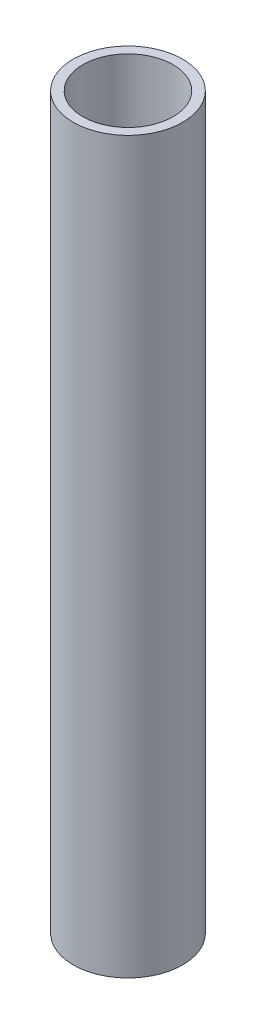
ISO-10303-21;
HEADER;
FILE_DESCRIPTION(('STEP AP214'),'2;1');
FILE_NAME('part.step','',(''),(''),'','','');
FILE_SCHEMA(('AUTOMOTIVE_DESIGN { 1 0 10303 214 1 1 1 1 }'));
ENDSEC;
DATA;
#1=APPLICATION_CONTEXT('core data for automotive mechanical design processes');
#2=APPLICATION_PROTOCOL_DEFINITION('international standard','automotive_design',2000,#1);
#3=PRODUCT_CONTEXT('',#1,'mechanical');
#4=PRODUCT('Part','Part','',(#3));
#5=PRODUCT_RELATED_PRODUCT_CATEGORY('part','',(#4));
#6=PRODUCT_DEFINITION_FORMATION('','',#4);
#7=PRODUCT_DEFINITION_CONTEXT('part definition',#1,'design');
#8=PRODUCT_DEFINITION('design','',#6,#7);
#9=PRODUCT_DEFINITION_SHAPE('','',#8);
#10=(LENGTH_UNIT() NAMED_UNIT(*) SI_UNIT(.MILLI.,.METRE.));
#11=(NAMED_UNIT(*) PLANE_ANGLE_UNIT() SI_UNIT($,.RADIAN.));
#12=(NAMED_UNIT(*) SI_UNIT($,.STERADIAN.) SOLID_ANGLE_UNIT());
#13=UNCERTAINTY_MEASURE_WITH_UNIT(LENGTH_MEASURE(1.E-05),#10,'distance_accuracy_value','');
#14=(GEOMETRIC_REPRESENTATION_CONTEXT(3) GLOBAL_UNCERTAINTY_ASSIGNED_CONTEXT((#13)) GLOBAL_UNIT_ASSIGNED_CONTEXT((#10,
#11,#12)) REPRESENTATION_CONTEXT('',''));
#15=CARTESIAN_POINT('',(0.,0.,0.));
#16=DIRECTION('',(0.,0.,1.));
#17=DIRECTION('',(1.,0.,0.));
#18=AXIS2_PLACEMENT_3D('',#15,#16,#17);
#19=CARTESIAN_POINT('',(0.,38.,0.));
#20=DIRECTION('',(0.,1.,0.));
#21=DIRECTION('',(0.,0.,1.));
#22=AXIS2_PLACEMENT_3D('',#19,#20,#21);
#23=PLANE('',#22);
#24=CARTESIAN_POINT('',(0.,38.,0.));
#25=DIRECTION('',(0.,1.,0.));
#26=DIRECTION('',(0.,0.,1.));
#27=AXIS2_PLACEMENT_3D('',#24,#25,#26);
#28=CIRCLE('',#27,2.85);
#29=CARTESIAN_POINT('',(0.,38.,2.85));
#30=VERTEX_POINT('',#29);
#31=EDGE_CURVE('E10',#30,#30,#28,.T.);
#32=ORIENTED_EDGE('',*,*,#31,.T.);
#33=EDGE_LOOP('',(#32));
#34=FACE_BOUND('',#33,.T.);
#35=CARTESIAN_POINT('',(0.,38.,0.));
#36=DIRECTION('',(0.,1.,0.));
#37=DIRECTION('',(0.,0.,1.));
#38=AXIS2_PLACEMENT_3D('',#35,#36,#37);
#39=CIRCLE('',#38,2.35);
#40=CARTESIAN_POINT('',(0.,38.,2.35));
#41=VERTEX_POINT('',#40);
#42=EDGE_CURVE('E44',#41,#41,#39,.T.);
#43=ORIENTED_EDGE('',*,*,#42,.F.);
#44=EDGE_LOOP('',(#43));
#45=FACE_BOUND('',#44,.T.);
#46=ADVANCED_FACE('F33',(#34,#45),#23,.T.);
#47=CARTESIAN_POINT('',(0.,0.,0.));
#48=DIRECTION('',(0.,1.,0.));
#49=DIRECTION('',(0.,0.,1.));
#50=AXIS2_PLACEMENT_3D('',#47,#48,#49);
#51=PLANE('',#50);
#52=CARTESIAN_POINT('',(0.,0.,0.));
#53=DIRECTION('',(0.,1.,0.));
#54=DIRECTION('',(0.,0.,1.));
#55=AXIS2_PLACEMENT_3D('',#52,#53,#54);
#56=CIRCLE('',#55,2.85);
#57=CARTESIAN_POINT('',(0.,0.,2.85));
#58=VERTEX_POINT('',#57);
#59=EDGE_CURVE('E37',#58,#58,#56,.T.);
#60=ORIENTED_EDGE('',*,*,#59,.F.);
#61=EDGE_LOOP('',(#60));
#62=FACE_BOUND('',#61,.T.);
#63=CARTESIAN_POINT('',(0.,0.,0.));
#64=DIRECTION('',(0.,1.,0.));
#65=DIRECTION('',(0.,0.,1.));
#66=AXIS2_PLACEMENT_3D('',#63,#64,#65);
#67=CIRCLE('',#66,2.35);
#68=CARTESIAN_POINT('',(0.,0.,2.35));
#69=VERTEX_POINT('',#68);
#70=EDGE_CURVE('E46',#69,#69,#67,.T.);
#71=ORIENTED_EDGE('',*,*,#70,.T.);
#72=EDGE_LOOP('',(#71));
#73=FACE_BOUND('',#72,.T.);
#74=ADVANCED_FACE('F56',(#62,#73),#51,.F.);
#75=CARTESIAN_POINT('',(0.,38.,0.));
#76=DIRECTION('',(0.,-1.,0.));
#77=DIRECTION('',(0.,0.,-1.));
#78=AXIS2_PLACEMENT_3D('',#75,#76,#77);
#79=CYLINDRICAL_SURFACE('',#78,2.85);
#80=ORIENTED_EDGE('',*,*,#31,.F.);
#81=EDGE_LOOP('',(#80));
#82=FACE_BOUND('',#81,.T.);
#83=ORIENTED_EDGE('',*,*,#59,.T.);
#84=EDGE_LOOP('',(#83));
#85=FACE_BOUND('',#84,.T.);
#86=ADVANCED_FACE('F35',(#82,#85),#79,.T.);
#87=CARTESIAN_POINT('',(0.,38.,0.));
#88=DIRECTION('',(0.,-1.,0.));
#89=DIRECTION('',(0.,0.,-1.));
#90=AXIS2_PLACEMENT_3D('',#87,#88,#89);
#91=CYLINDRICAL_SURFACE('',#90,2.35);
#92=ORIENTED_EDGE('',*,*,#42,.T.);
#93=EDGE_LOOP('',(#92));
#94=FACE_BOUND('',#93,.T.);
#95=ORIENTED_EDGE('',*,*,#70,.F.);
#96=EDGE_LOOP('',(#95));
#97=FACE_BOUND('',#96,.T.);
#98=ADVANCED_FACE('F52',(#94,#97),#91,.F.);
#99=CLOSED_SHELL('',(#46,#74,#86,#98));
#100=MANIFOLD_SOLID_BREP('B2',#99);
#101=ADVANCED_BREP_SHAPE_REPRESENTATION('',(#18,#100),#14);
#102=SHAPE_DEFINITION_REPRESENTATION(#9,#101);
ENDSEC;
END-ISO-10303-21;
